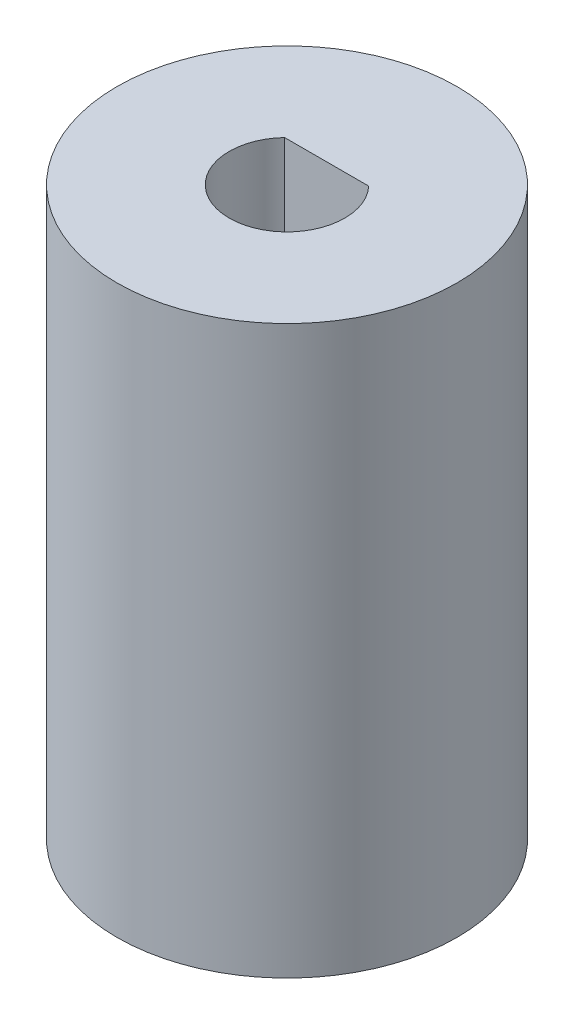
ISO-10303-21;
HEADER;
FILE_DESCRIPTION(('STEP AP214'),'2;1');
FILE_NAME('part.step','',(''),(''),'','','');
FILE_SCHEMA(('AUTOMOTIVE_DESIGN { 1 0 10303 214 1 1 1 1 }'));
ENDSEC;
DATA;
#1=APPLICATION_CONTEXT('core data for automotive mechanical design processes');
#2=APPLICATION_PROTOCOL_DEFINITION('international standard','automotive_design',2000,#1);
#3=PRODUCT_CONTEXT('',#1,'mechanical');
#4=PRODUCT('Part','Part','',(#3));
#5=PRODUCT_RELATED_PRODUCT_CATEGORY('part','',(#4));
#6=PRODUCT_DEFINITION_FORMATION('','',#4);
#7=PRODUCT_DEFINITION_CONTEXT('part definition',#1,'design');
#8=PRODUCT_DEFINITION('design','',#6,#7);
#9=PRODUCT_DEFINITION_SHAPE('','',#8);
#10=(LENGTH_UNIT() NAMED_UNIT(*) SI_UNIT(.MILLI.,.METRE.));
#11=(NAMED_UNIT(*) PLANE_ANGLE_UNIT() SI_UNIT($,.RADIAN.));
#12=(NAMED_UNIT(*) SI_UNIT($,.STERADIAN.) SOLID_ANGLE_UNIT());
#13=UNCERTAINTY_MEASURE_WITH_UNIT(LENGTH_MEASURE(1.E-05),#10,'distance_accuracy_value','');
#14=(GEOMETRIC_REPRESENTATION_CONTEXT(3) GLOBAL_UNCERTAINTY_ASSIGNED_CONTEXT((#13)) GLOBAL_UNIT_ASSIGNED_CONTEXT((#10,
#11,#12)) REPRESENTATION_CONTEXT('',''));
#15=CARTESIAN_POINT('',(0.,0.,0.));
#16=DIRECTION('',(0.,0.,1.));
#17=DIRECTION('',(1.,0.,0.));
#18=AXIS2_PLACEMENT_3D('',#15,#16,#17);
#19=CARTESIAN_POINT('',(0.,0.,0.));
#20=DIRECTION('',(0.,1.,0.));
#21=DIRECTION('',(0.,0.,1.));
#22=AXIS2_PLACEMENT_3D('',#19,#20,#21);
#23=PLANE('',#22);
#24=CARTESIAN_POINT('',(0.,0.,0.));
#25=DIRECTION('',(0.,1.,0.));
#26=DIRECTION('',(0.,0.,1.));
#27=AXIS2_PLACEMENT_3D('',#24,#25,#26);
#28=CIRCLE('',#27,15.);
#29=CARTESIAN_POINT('',(0.,0.,15.));
#30=VERTEX_POINT('',#29);
#31=EDGE_CURVE('E37',#30,#30,#28,.T.);
#32=ORIENTED_EDGE('',*,*,#31,.F.);
#33=EDGE_LOOP('',(#32));
#34=FACE_BOUND('',#33,.T.);
#35=DIRECTION('',(0.499999999999998,0.,0.86602540378444));
#36=VECTOR('',#35,1.);
#37=CARTESIAN_POINT('',(-4.87500000000001,0.,2.81458256229942));
#38=LINE('',#37,#36);
#39=CARTESIAN_POINT('',(-6.5,0.,0.));
#40=VERTEX_POINT('',#39);
#41=CARTESIAN_POINT('',(-3.25000000000002,0.,5.62916512459884));
#42=VERTEX_POINT('',#41);
#43=EDGE_CURVE('E48',#40,#42,#38,.T.);
#44=ORIENTED_EDGE('',*,*,#43,.T.);
#45=DIRECTION('',(1.,0.,0.));
#46=VECTOR('',#45,1.);
#47=CARTESIAN_POINT('',(0.,0.,5.62916512459884));
#48=LINE('',#47,#46);
#49=CARTESIAN_POINT('',(3.25000000000002,0.,5.62916512459884));
#50=VERTEX_POINT('',#49);
#51=EDGE_CURVE('E117',#42,#50,#48,.T.);
#52=ORIENTED_EDGE('',*,*,#51,.T.);
#53=DIRECTION('',(0.499999999999998,0.,-0.86602540378444));
#54=VECTOR('',#53,1.);
#55=CARTESIAN_POINT('',(4.87500000000001,0.,2.81458256229942));
#56=LINE('',#55,#54);
#57=CARTESIAN_POINT('',(6.5,0.,0.));
#58=VERTEX_POINT('',#57);
#59=EDGE_CURVE('E140',#50,#58,#56,.T.);
#60=ORIENTED_EDGE('',*,*,#59,.T.);
#61=DIRECTION('',(0.499999999999998,0.,0.86602540378444));
#62=VECTOR('',#61,1.);
#63=CARTESIAN_POINT('',(4.87500000000001,0.,-2.81458256229942));
#64=LINE('',#63,#62);
#65=CARTESIAN_POINT('',(3.25000000000002,0.,-5.62916512459884));
#66=VERTEX_POINT('',#65);
#67=EDGE_CURVE('E137',#66,#58,#64,.T.);
#68=ORIENTED_EDGE('',*,*,#67,.F.);
#69=DIRECTION('',(1.,0.,0.));
#70=VECTOR('',#69,1.);
#71=CARTESIAN_POINT('',(0.,0.,-5.62916512459884));
#72=LINE('',#71,#70);
#73=CARTESIAN_POINT('',(-3.25000000000002,0.,-5.62916512459884));
#74=VERTEX_POINT('',#73);
#75=EDGE_CURVE('E134',#74,#66,#72,.T.);
#76=ORIENTED_EDGE('',*,*,#75,.F.);
#77=DIRECTION('',(0.499999999999998,0.,-0.86602540378444));
#78=VECTOR('',#77,1.);
#79=CARTESIAN_POINT('',(-4.87500000000001,0.,-2.81458256229942));
#80=LINE('',#79,#78);
#81=EDGE_CURVE('E132',#40,#74,#80,.T.);
#82=ORIENTED_EDGE('',*,*,#81,.F.);
#83=EDGE_LOOP('',(#44,#52,#60,#68,#76,#82));
#84=FACE_BOUND('',#83,.T.);
#85=ADVANCED_FACE('F33',(#34,#84),#23,.F.);
#86=CARTESIAN_POINT('',(0.,50.,0.));
#87=DIRECTION('',(0.,-1.,0.));
#88=DIRECTION('',(0.,0.,-1.));
#89=AXIS2_PLACEMENT_3D('',#86,#87,#88);
#90=CYLINDRICAL_SURFACE('',#89,15.);
#91=CARTESIAN_POINT('',(0.,50.,0.));
#92=DIRECTION('',(0.,1.,0.));
#93=DIRECTION('',(0.,0.,1.));
#94=AXIS2_PLACEMENT_3D('',#91,#92,#93);
#95=CIRCLE('',#94,15.);
#96=CARTESIAN_POINT('',(0.,50.,15.));
#97=VERTEX_POINT('',#96);
#98=EDGE_CURVE('E11',#97,#97,#95,.T.);
#99=ORIENTED_EDGE('',*,*,#98,.F.);
#100=EDGE_LOOP('',(#99));
#101=FACE_BOUND('',#100,.T.);
#102=ORIENTED_EDGE('',*,*,#31,.T.);
#103=EDGE_LOOP('',(#102));
#104=FACE_BOUND('',#103,.T.);
#105=ADVANCED_FACE('F35',(#101,#104),#90,.T.);
#106=CARTESIAN_POINT('',(0.,50.,0.));
#107=DIRECTION('',(0.,1.,0.));
#108=DIRECTION('',(0.,0.,1.));
#109=AXIS2_PLACEMENT_3D('',#106,#107,#108);
#110=PLANE('',#109);
#111=CARTESIAN_POINT('',(0.,50.,0.));
#112=DIRECTION('',(0.,1.,0.));
#113=DIRECTION('',(0.,0.,1.));
#114=AXIS2_PLACEMENT_3D('',#111,#112,#113);
#115=CIRCLE('',#114,5.1);
#116=CARTESIAN_POINT('',(-3.70944739819828,50.,-3.5));
#117=VERTEX_POINT('',#116);
#118=CARTESIAN_POINT('',(3.70944739819828,50.,-3.5));
#119=VERTEX_POINT('',#118);
#120=EDGE_CURVE('E56',#117,#119,#115,.T.);
#121=ORIENTED_EDGE('',*,*,#120,.F.);
#122=DIRECTION('',(-1.,0.,0.));
#123=VECTOR('',#122,1.);
#124=CARTESIAN_POINT('',(-3.70944739819828,50.,-3.5));
#125=LINE('',#124,#123);
#126=EDGE_CURVE('E157',#119,#117,#125,.T.);
#127=ORIENTED_EDGE('',*,*,#126,.F.);
#128=EDGE_LOOP('',(#121,#127));
#129=FACE_BOUND('',#128,.T.);
#130=ORIENTED_EDGE('',*,*,#98,.T.);
#131=EDGE_LOOP('',(#130));
#132=FACE_BOUND('',#131,.T.);
#133=ADVANCED_FACE('F172',(#129,#132),#110,.T.);
#134=CARTESIAN_POINT('',(0.,30.,0.));
#135=DIRECTION('',(0.,1.,0.));
#136=DIRECTION('',(0.,0.,1.));
#137=AXIS2_PLACEMENT_3D('',#134,#135,#136);
#138=CYLINDRICAL_SURFACE('',#137,5.1);
#139=ORIENTED_EDGE('',*,*,#120,.T.);
#140=DIRECTION('',(0.,1.,0.));
#141=VECTOR('',#140,1.);
#142=CARTESIAN_POINT('',(3.70944739819828,30.,-3.5));
#143=LINE('',#142,#141);
#144=CARTESIAN_POINT('',(3.70944739819828,30.,-3.5));
#145=VERTEX_POINT('',#144);
#146=EDGE_CURVE('E159',#145,#119,#143,.T.);
#147=ORIENTED_EDGE('',*,*,#146,.F.);
#148=CARTESIAN_POINT('',(0.,30.,0.));
#149=DIRECTION('',(0.,1.,0.));
#150=DIRECTION('',(0.,0.,1.));
#151=AXIS2_PLACEMENT_3D('',#148,#149,#150);
#152=CIRCLE('',#151,5.1);
#153=CARTESIAN_POINT('',(-3.70944739819828,30.,-3.5));
#154=VERTEX_POINT('',#153);
#155=EDGE_CURVE('E154',#154,#145,#152,.T.);
#156=ORIENTED_EDGE('',*,*,#155,.F.);
#157=DIRECTION('',(0.,1.,0.));
#158=VECTOR('',#157,1.);
#159=CARTESIAN_POINT('',(-3.70944739819828,30.,-3.5));
#160=LINE('',#159,#158);
#161=EDGE_CURVE('E163',#154,#117,#160,.T.);
#162=ORIENTED_EDGE('',*,*,#161,.T.);
#163=EDGE_LOOP('',(#139,#147,#156,#162));
#164=FACE_BOUND('',#163,.T.);
#165=ADVANCED_FACE('F175',(#164),#138,.F.);
#166=CARTESIAN_POINT('',(-3.70944739819828,30.,-3.5));
#167=DIRECTION('',(0.,0.,-1.));
#168=DIRECTION('',(-1.,0.,0.));
#169=AXIS2_PLACEMENT_3D('',#166,#167,#168);
#170=PLANE('',#169);
#171=ORIENTED_EDGE('',*,*,#126,.T.);
#172=ORIENTED_EDGE('',*,*,#161,.F.);
#173=DIRECTION('',(-1.,0.,0.));
#174=VECTOR('',#173,1.);
#175=CARTESIAN_POINT('',(-3.70944739819828,30.,-3.5));
#176=LINE('',#175,#174);
#177=EDGE_CURVE('E156',#145,#154,#176,.T.);
#178=ORIENTED_EDGE('',*,*,#177,.F.);
#179=ORIENTED_EDGE('',*,*,#146,.T.);
#180=EDGE_LOOP('',(#171,#172,#178,#179));
#181=FACE_BOUND('',#180,.T.);
#182=ADVANCED_FACE('F168',(#181),#170,.F.);
#183=CARTESIAN_POINT('',(0.,30.,0.));
#184=DIRECTION('',(0.,-1.,0.));
#185=DIRECTION('',(0.,0.,-1.));
#186=AXIS2_PLACEMENT_3D('',#183,#184,#185);
#187=PLANE('',#186);
#188=DIRECTION('',(0.499999999999998,0.,0.86602540378444));
#189=VECTOR('',#188,1.);
#190=CARTESIAN_POINT('',(-4.87500000000001,30.,2.81458256229942));
#191=LINE('',#190,#189);
#192=CARTESIAN_POINT('',(-6.5,30.,0.));
#193=VERTEX_POINT('',#192);
#194=CARTESIAN_POINT('',(-3.25000000000002,30.,5.62916512459884));
#195=VERTEX_POINT('',#194);
#196=EDGE_CURVE('E101',#193,#195,#191,.T.);
#197=ORIENTED_EDGE('',*,*,#196,.F.);
#198=DIRECTION('',(0.499999999999998,0.,-0.86602540378444));
#199=VECTOR('',#198,1.);
#200=CARTESIAN_POINT('',(-4.87500000000001,30.,-2.81458256229942));
#201=LINE('',#200,#199);
#202=CARTESIAN_POINT('',(-3.25000000000002,30.,-5.62916512459884));
#203=VERTEX_POINT('',#202);
#204=EDGE_CURVE('E115',#193,#203,#201,.T.);
#205=ORIENTED_EDGE('',*,*,#204,.T.);
#206=DIRECTION('',(1.,0.,0.));
#207=VECTOR('',#206,1.);
#208=CARTESIAN_POINT('',(0.,30.,-5.62916512459884));
#209=LINE('',#208,#207);
#210=CARTESIAN_POINT('',(3.25000000000002,30.,-5.62916512459884));
#211=VERTEX_POINT('',#210);
#212=EDGE_CURVE('E121',#203,#211,#209,.T.);
#213=ORIENTED_EDGE('',*,*,#212,.T.);
#214=DIRECTION('',(0.499999999999998,0.,0.86602540378444));
#215=VECTOR('',#214,1.);
#216=CARTESIAN_POINT('',(4.87500000000001,30.,-2.81458256229942));
#217=LINE('',#216,#215);
#218=CARTESIAN_POINT('',(6.5,30.,0.));
#219=VERTEX_POINT('',#218);
#220=EDGE_CURVE('E123',#211,#219,#217,.T.);
#221=ORIENTED_EDGE('',*,*,#220,.T.);
#222=DIRECTION('',(0.499999999999998,0.,-0.86602540378444));
#223=VECTOR('',#222,1.);
#224=CARTESIAN_POINT('',(4.87500000000001,30.,2.81458256229942));
#225=LINE('',#224,#223);
#226=CARTESIAN_POINT('',(3.25000000000002,30.,5.62916512459884));
#227=VERTEX_POINT('',#226);
#228=EDGE_CURVE('E128',#227,#219,#225,.T.);
#229=ORIENTED_EDGE('',*,*,#228,.F.);
#230=DIRECTION('',(1.,0.,0.));
#231=VECTOR('',#230,1.);
#232=CARTESIAN_POINT('',(0.,30.,5.62916512459884));
#233=LINE('',#232,#231);
#234=EDGE_CURVE('E108',#195,#227,#233,.T.);
#235=ORIENTED_EDGE('',*,*,#234,.F.);
#236=EDGE_LOOP('',(#197,#205,#213,#221,#229,#235));
#237=FACE_BOUND('',#236,.T.);
#238=ORIENTED_EDGE('',*,*,#155,.T.);
#239=ORIENTED_EDGE('',*,*,#177,.T.);
#240=EDGE_LOOP('',(#238,#239));
#241=FACE_BOUND('',#240,.T.);
#242=ADVANCED_FACE('F112',(#237,#241),#187,.T.);
#243=CARTESIAN_POINT('',(-4.87500000000001,30.,2.81458256229942));
#244=DIRECTION('',(0.86602540378444,0.,-0.499999999999998));
#245=DIRECTION('',(-0.499999999999998,0.,-0.86602540378444));
#246=AXIS2_PLACEMENT_3D('',#243,#244,#245);
#247=PLANE('',#246);
#248=ORIENTED_EDGE('',*,*,#43,.F.);
#249=DIRECTION('',(0.,-1.,0.));
#250=VECTOR('',#249,1.);
#251=CARTESIAN_POINT('',(-6.5,30.,0.));
#252=LINE('',#251,#250);
#253=EDGE_CURVE('E98',#193,#40,#252,.T.);
#254=ORIENTED_EDGE('',*,*,#253,.F.);
#255=ORIENTED_EDGE('',*,*,#196,.T.);
#256=DIRECTION('',(0.,-1.,0.));
#257=VECTOR('',#256,1.);
#258=CARTESIAN_POINT('',(-3.25000000000002,30.,5.62916512459884));
#259=LINE('',#258,#257);
#260=EDGE_CURVE('E145',#195,#42,#259,.T.);
#261=ORIENTED_EDGE('',*,*,#260,.T.);
#262=EDGE_LOOP('',(#248,#254,#255,#261));
#263=FACE_BOUND('',#262,.T.);
#264=ADVANCED_FACE('F100',(#263),#247,.T.);
#265=CARTESIAN_POINT('',(0.,30.,5.62916512459884));
#266=DIRECTION('',(0.,0.,-1.));
#267=DIRECTION('',(-1.,0.,0.));
#268=AXIS2_PLACEMENT_3D('',#265,#266,#267);
#269=PLANE('',#268);
#270=ORIENTED_EDGE('',*,*,#51,.F.);
#271=ORIENTED_EDGE('',*,*,#260,.F.);
#272=ORIENTED_EDGE('',*,*,#234,.T.);
#273=DIRECTION('',(0.,-1.,0.));
#274=VECTOR('',#273,1.);
#275=CARTESIAN_POINT('',(3.25000000000002,30.,5.62916512459884));
#276=LINE('',#275,#274);
#277=EDGE_CURVE('E147',#227,#50,#276,.T.);
#278=ORIENTED_EDGE('',*,*,#277,.T.);
#279=EDGE_LOOP('',(#270,#271,#272,#278));
#280=FACE_BOUND('',#279,.T.);
#281=ADVANCED_FACE('F199',(#280),#269,.T.);
#282=CARTESIAN_POINT('',(4.87500000000001,30.,2.81458256229942));
#283=DIRECTION('',(-0.86602540378444,0.,-0.499999999999998));
#284=DIRECTION('',(-0.499999999999998,0.,0.86602540378444));
#285=AXIS2_PLACEMENT_3D('',#282,#283,#284);
#286=PLANE('',#285);
#287=ORIENTED_EDGE('',*,*,#59,.F.);
#288=ORIENTED_EDGE('',*,*,#277,.F.);
#289=ORIENTED_EDGE('',*,*,#228,.T.);
#290=DIRECTION('',(0.,-1.,0.));
#291=VECTOR('',#290,1.);
#292=CARTESIAN_POINT('',(6.5,30.,0.));
#293=LINE('',#292,#291);
#294=EDGE_CURVE('E149',#219,#58,#293,.T.);
#295=ORIENTED_EDGE('',*,*,#294,.T.);
#296=EDGE_LOOP('',(#287,#288,#289,#295));
#297=FACE_BOUND('',#296,.T.);
#298=ADVANCED_FACE('F196',(#297),#286,.T.);
#299=CARTESIAN_POINT('',(4.87500000000001,30.,-2.81458256229942));
#300=DIRECTION('',(0.86602540378444,0.,-0.499999999999998));
#301=DIRECTION('',(-0.499999999999998,0.,-0.86602540378444));
#302=AXIS2_PLACEMENT_3D('',#299,#300,#301);
#303=PLANE('',#302);
#304=ORIENTED_EDGE('',*,*,#67,.T.);
#305=ORIENTED_EDGE('',*,*,#294,.F.);
#306=ORIENTED_EDGE('',*,*,#220,.F.);
#307=DIRECTION('',(0.,-1.,0.));
#308=VECTOR('',#307,1.);
#309=CARTESIAN_POINT('',(3.25000000000002,30.,-5.62916512459884));
#310=LINE('',#309,#308);
#311=EDGE_CURVE('E151',#211,#66,#310,.T.);
#312=ORIENTED_EDGE('',*,*,#311,.T.);
#313=EDGE_LOOP('',(#304,#305,#306,#312));
#314=FACE_BOUND('',#313,.T.);
#315=ADVANCED_FACE('F193',(#314),#303,.F.);
#316=CARTESIAN_POINT('',(0.,30.,-5.62916512459884));
#317=DIRECTION('',(0.,0.,-1.));
#318=DIRECTION('',(-1.,0.,0.));
#319=AXIS2_PLACEMENT_3D('',#316,#317,#318);
#320=PLANE('',#319);
#321=ORIENTED_EDGE('',*,*,#75,.T.);
#322=ORIENTED_EDGE('',*,*,#311,.F.);
#323=ORIENTED_EDGE('',*,*,#212,.F.);
#324=DIRECTION('',(0.,-1.,0.));
#325=VECTOR('',#324,1.);
#326=CARTESIAN_POINT('',(-3.25000000000002,30.,-5.62916512459884));
#327=LINE('',#326,#325);
#328=EDGE_CURVE('E107',#203,#74,#327,.T.);
#329=ORIENTED_EDGE('',*,*,#328,.T.);
#330=EDGE_LOOP('',(#321,#322,#323,#329));
#331=FACE_BOUND('',#330,.T.);
#332=ADVANCED_FACE('F189',(#331),#320,.F.);
#333=CARTESIAN_POINT('',(-4.87500000000001,30.,-2.81458256229942));
#334=DIRECTION('',(-0.86602540378444,0.,-0.499999999999998));
#335=DIRECTION('',(-0.499999999999998,0.,0.86602540378444));
#336=AXIS2_PLACEMENT_3D('',#333,#334,#335);
#337=PLANE('',#336);
#338=ORIENTED_EDGE('',*,*,#81,.T.);
#339=ORIENTED_EDGE('',*,*,#328,.F.);
#340=ORIENTED_EDGE('',*,*,#204,.F.);
#341=ORIENTED_EDGE('',*,*,#253,.T.);
#342=EDGE_LOOP('',(#338,#339,#340,#341));
#343=FACE_BOUND('',#342,.T.);
#344=ADVANCED_FACE('F119',(#343),#337,.F.);
#345=CLOSED_SHELL('',(#85,#105,#133,#165,#182,#242,#264,#281,#298,#315,#332,#344));
#346=MANIFOLD_SOLID_BREP('B2',#345);
#347=ADVANCED_BREP_SHAPE_REPRESENTATION('',(#18,#346),#14);
#348=SHAPE_DEFINITION_REPRESENTATION(#9,#347);
ENDSEC;
END-ISO-10303-21;
